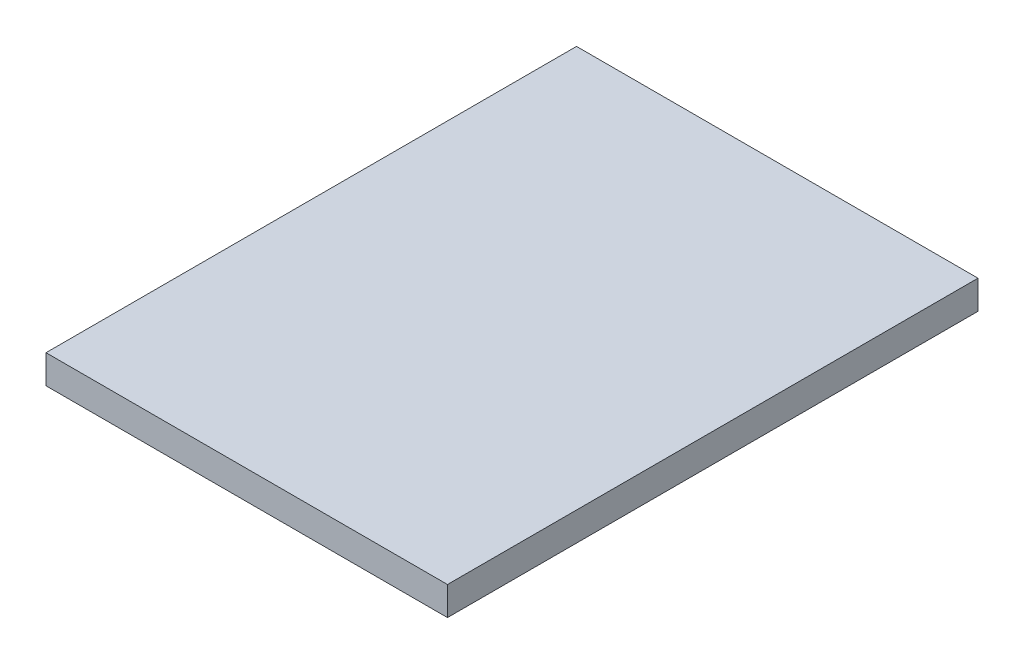
ISO-10303-21;
HEADER;
FILE_DESCRIPTION(('STEP AP214'),'2;1');
FILE_NAME('part.step','',(''),(''),'','','');
FILE_SCHEMA(('AUTOMOTIVE_DESIGN { 1 0 10303 214 1 1 1 1 }'));
ENDSEC;
DATA;
#1=APPLICATION_CONTEXT('core data for automotive mechanical design processes');
#2=APPLICATION_PROTOCOL_DEFINITION('international standard','automotive_design',2000,#1);
#3=PRODUCT_CONTEXT('',#1,'mechanical');
#4=PRODUCT('Part','Part','',(#3));
#5=PRODUCT_RELATED_PRODUCT_CATEGORY('part','',(#4));
#6=PRODUCT_DEFINITION_FORMATION('','',#4);
#7=PRODUCT_DEFINITION_CONTEXT('part definition',#1,'design');
#8=PRODUCT_DEFINITION('design','',#6,#7);
#9=PRODUCT_DEFINITION_SHAPE('','',#8);
#10=(LENGTH_UNIT() NAMED_UNIT(*) SI_UNIT(.MILLI.,.METRE.));
#11=(NAMED_UNIT(*) PLANE_ANGLE_UNIT() SI_UNIT($,.RADIAN.));
#12=(NAMED_UNIT(*) SI_UNIT($,.STERADIAN.) SOLID_ANGLE_UNIT());
#13=UNCERTAINTY_MEASURE_WITH_UNIT(LENGTH_MEASURE(1.E-05),#10,'distance_accuracy_value','');
#14=(GEOMETRIC_REPRESENTATION_CONTEXT(3) GLOBAL_UNCERTAINTY_ASSIGNED_CONTEXT((#13)) GLOBAL_UNIT_ASSIGNED_CONTEXT((#10,
#11,#12)) REPRESENTATION_CONTEXT('',''));
#15=CARTESIAN_POINT('',(0.,0.,0.));
#16=DIRECTION('',(0.,0.,1.));
#17=DIRECTION('',(1.,0.,0.));
#18=AXIS2_PLACEMENT_3D('',#15,#16,#17);
#19=CARTESIAN_POINT('',(-112.,16.,148.));
#20=DIRECTION('',(1.,0.,0.));
#21=DIRECTION('',(0.,0.,-1.));
#22=AXIS2_PLACEMENT_3D('',#19,#20,#21);
#23=PLANE('',#22);
#24=DIRECTION('',(0.,0.,1.));
#25=VECTOR('',#24,1.);
#26=CARTESIAN_POINT('',(-112.,0.,148.));
#27=LINE('',#26,#25);
#28=CARTESIAN_POINT('',(-112.,0.,-148.));
#29=VERTEX_POINT('',#28);
#30=CARTESIAN_POINT('',(-112.,0.,148.));
#31=VERTEX_POINT('',#30);
#32=EDGE_CURVE('E111',#29,#31,#27,.T.);
#33=ORIENTED_EDGE('',*,*,#32,.T.);
#34=DIRECTION('',(0.,-1.,0.));
#35=VECTOR('',#34,1.);
#36=CARTESIAN_POINT('',(-112.,16.,148.));
#37=LINE('',#36,#35);
#38=CARTESIAN_POINT('',(-112.,16.,148.));
#39=VERTEX_POINT('',#38);
#40=EDGE_CURVE('E11',#39,#31,#37,.T.);
#41=ORIENTED_EDGE('',*,*,#40,.F.);
#42=DIRECTION('',(0.,0.,1.));
#43=VECTOR('',#42,1.);
#44=CARTESIAN_POINT('',(-112.,16.,148.));
#45=LINE('',#44,#43);
#46=CARTESIAN_POINT('',(-112.,16.,-148.));
#47=VERTEX_POINT('',#46);
#48=EDGE_CURVE('E95',#47,#39,#45,.T.);
#49=ORIENTED_EDGE('',*,*,#48,.F.);
#50=DIRECTION('',(0.,-1.,0.));
#51=VECTOR('',#50,1.);
#52=CARTESIAN_POINT('',(-112.,16.,-148.));
#53=LINE('',#52,#51);
#54=EDGE_CURVE('E107',#47,#29,#53,.T.);
#55=ORIENTED_EDGE('',*,*,#54,.T.);
#56=EDGE_LOOP('',(#33,#41,#49,#55));
#57=FACE_BOUND('',#56,.T.);
#58=ADVANCED_FACE('F43',(#57),#23,.F.);
#59=CARTESIAN_POINT('',(112.,16.,148.));
#60=DIRECTION('',(0.,0.,-1.));
#61=DIRECTION('',(-1.,0.,0.));
#62=AXIS2_PLACEMENT_3D('',#59,#60,#61);
#63=PLANE('',#62);
#64=DIRECTION('',(1.,0.,0.));
#65=VECTOR('',#64,1.);
#66=CARTESIAN_POINT('',(112.,0.,148.));
#67=LINE('',#66,#65);
#68=CARTESIAN_POINT('',(112.,0.,148.));
#69=VERTEX_POINT('',#68);
#70=EDGE_CURVE('E100',#31,#69,#67,.T.);
#71=ORIENTED_EDGE('',*,*,#70,.T.);
#72=DIRECTION('',(0.,-1.,0.));
#73=VECTOR('',#72,1.);
#74=CARTESIAN_POINT('',(112.,16.,148.));
#75=LINE('',#74,#73);
#76=CARTESIAN_POINT('',(112.,16.,148.));
#77=VERTEX_POINT('',#76);
#78=EDGE_CURVE('E52',#77,#69,#75,.T.);
#79=ORIENTED_EDGE('',*,*,#78,.F.);
#80=DIRECTION('',(1.,0.,0.));
#81=VECTOR('',#80,1.);
#82=CARTESIAN_POINT('',(112.,16.,148.));
#83=LINE('',#82,#81);
#84=EDGE_CURVE('E90',#39,#77,#83,.T.);
#85=ORIENTED_EDGE('',*,*,#84,.F.);
#86=ORIENTED_EDGE('',*,*,#40,.T.);
#87=EDGE_LOOP('',(#71,#79,#85,#86));
#88=FACE_BOUND('',#87,.T.);
#89=ADVANCED_FACE('F99',(#88),#63,.F.);
#90=CARTESIAN_POINT('',(112.,16.,148.));
#91=DIRECTION('',(-1.,0.,0.));
#92=DIRECTION('',(0.,0.,1.));
#93=AXIS2_PLACEMENT_3D('',#90,#91,#92);
#94=PLANE('',#93);
#95=DIRECTION('',(0.,0.,-1.));
#96=VECTOR('',#95,1.);
#97=CARTESIAN_POINT('',(112.,0.,148.));
#98=LINE('',#97,#96);
#99=CARTESIAN_POINT('',(112.,0.,-148.));
#100=VERTEX_POINT('',#99);
#101=EDGE_CURVE('E77',#69,#100,#98,.T.);
#102=ORIENTED_EDGE('',*,*,#101,.T.);
#103=DIRECTION('',(0.,-1.,0.));
#104=VECTOR('',#103,1.);
#105=CARTESIAN_POINT('',(112.,16.,-148.));
#106=LINE('',#105,#104);
#107=CARTESIAN_POINT('',(112.,16.,-148.));
#108=VERTEX_POINT('',#107);
#109=EDGE_CURVE('E102',#108,#100,#106,.T.);
#110=ORIENTED_EDGE('',*,*,#109,.F.);
#111=DIRECTION('',(0.,0.,-1.));
#112=VECTOR('',#111,1.);
#113=CARTESIAN_POINT('',(112.,16.,148.));
#114=LINE('',#113,#112);
#115=EDGE_CURVE('E93',#77,#108,#114,.T.);
#116=ORIENTED_EDGE('',*,*,#115,.F.);
#117=ORIENTED_EDGE('',*,*,#78,.T.);
#118=EDGE_LOOP('',(#102,#110,#116,#117));
#119=FACE_BOUND('',#118,.T.);
#120=ADVANCED_FACE('F103',(#119),#94,.F.);
#121=CARTESIAN_POINT('',(112.,16.,-148.));
#122=DIRECTION('',(0.,0.,1.));
#123=DIRECTION('',(1.,0.,0.));
#124=AXIS2_PLACEMENT_3D('',#121,#122,#123);
#125=PLANE('',#124);
#126=DIRECTION('',(-1.,0.,0.));
#127=VECTOR('',#126,1.);
#128=CARTESIAN_POINT('',(112.,0.,-148.));
#129=LINE('',#128,#127);
#130=EDGE_CURVE('E83',#100,#29,#129,.T.);
#131=ORIENTED_EDGE('',*,*,#130,.T.);
#132=ORIENTED_EDGE('',*,*,#54,.F.);
#133=DIRECTION('',(-1.,0.,0.));
#134=VECTOR('',#133,1.);
#135=CARTESIAN_POINT('',(112.,16.,-148.));
#136=LINE('',#135,#134);
#137=EDGE_CURVE('E60',#108,#47,#136,.T.);
#138=ORIENTED_EDGE('',*,*,#137,.F.);
#139=ORIENTED_EDGE('',*,*,#109,.T.);
#140=EDGE_LOOP('',(#131,#132,#138,#139));
#141=FACE_BOUND('',#140,.T.);
#142=ADVANCED_FACE('F124',(#141),#125,.F.);
#143=CARTESIAN_POINT('',(0.,16.,0.));
#144=DIRECTION('',(0.,1.,0.));
#145=DIRECTION('',(0.,0.,1.));
#146=AXIS2_PLACEMENT_3D('',#143,#144,#145);
#147=PLANE('',#146);
#148=ORIENTED_EDGE('',*,*,#48,.T.);
#149=ORIENTED_EDGE('',*,*,#84,.T.);
#150=ORIENTED_EDGE('',*,*,#115,.T.);
#151=ORIENTED_EDGE('',*,*,#137,.T.);
#152=EDGE_LOOP('',(#148,#149,#150,#151));
#153=FACE_BOUND('',#152,.T.);
#154=ADVANCED_FACE('F91',(#153),#147,.T.);
#155=CARTESIAN_POINT('',(0.,0.,0.));
#156=DIRECTION('',(0.,1.,0.));
#157=DIRECTION('',(0.,0.,1.));
#158=AXIS2_PLACEMENT_3D('',#155,#156,#157);
#159=PLANE('',#158);
#160=ORIENTED_EDGE('',*,*,#32,.F.);
#161=ORIENTED_EDGE('',*,*,#130,.F.);
#162=ORIENTED_EDGE('',*,*,#101,.F.);
#163=ORIENTED_EDGE('',*,*,#70,.F.);
#164=EDGE_LOOP('',(#160,#161,#162,#163));
#165=FACE_BOUND('',#164,.T.);
#166=ADVANCED_FACE('F127',(#165),#159,.F.);
#167=CLOSED_SHELL('',(#58,#89,#120,#142,#154,#166));
#168=MANIFOLD_SOLID_BREP('B2',#167);
#169=ADVANCED_BREP_SHAPE_REPRESENTATION('',(#18,#168),#14);
#170=SHAPE_DEFINITION_REPRESENTATION(#9,#169);
ENDSEC;
END-ISO-10303-21;
